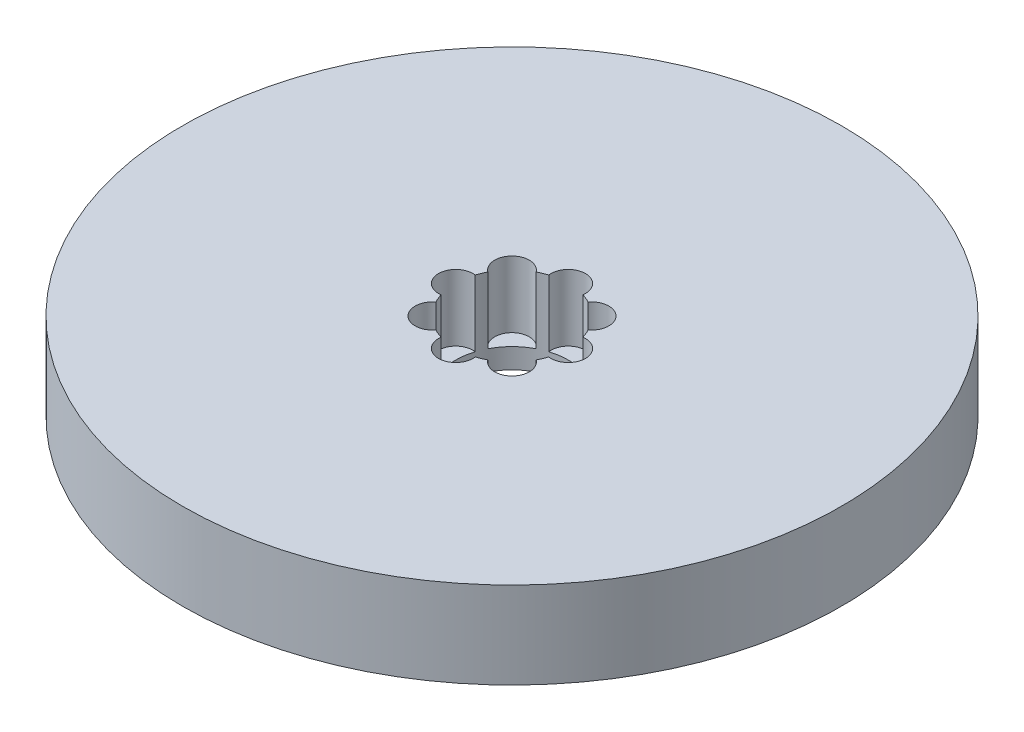
ISO-10303-21;
HEADER;
FILE_DESCRIPTION(('STEP AP214'),'2;1');
FILE_NAME('part.step','',(''),(''),'','','');
FILE_SCHEMA(('AUTOMOTIVE_DESIGN { 1 0 10303 214 1 1 1 1 }'));
ENDSEC;
DATA;
#1=APPLICATION_CONTEXT('core data for automotive mechanical design processes');
#2=APPLICATION_PROTOCOL_DEFINITION('international standard','automotive_design',2000,#1);
#3=PRODUCT_CONTEXT('',#1,'mechanical');
#4=PRODUCT('Part','Part','',(#3));
#5=PRODUCT_RELATED_PRODUCT_CATEGORY('part','',(#4));
#6=PRODUCT_DEFINITION_FORMATION('','',#4);
#7=PRODUCT_DEFINITION_CONTEXT('part definition',#1,'design');
#8=PRODUCT_DEFINITION('design','',#6,#7);
#9=PRODUCT_DEFINITION_SHAPE('','',#8);
#10=(LENGTH_UNIT() NAMED_UNIT(*) SI_UNIT(.MILLI.,.METRE.));
#11=(NAMED_UNIT(*) PLANE_ANGLE_UNIT() SI_UNIT($,.RADIAN.));
#12=(NAMED_UNIT(*) SI_UNIT($,.STERADIAN.) SOLID_ANGLE_UNIT());
#13=UNCERTAINTY_MEASURE_WITH_UNIT(LENGTH_MEASURE(1.E-05),#10,'distance_accuracy_value','');
#14=(GEOMETRIC_REPRESENTATION_CONTEXT(3) GLOBAL_UNCERTAINTY_ASSIGNED_CONTEXT((#13)) GLOBAL_UNIT_ASSIGNED_CONTEXT((#10,
#11,#12)) REPRESENTATION_CONTEXT('',''));
#15=CARTESIAN_POINT('',(0.,0.,0.));
#16=DIRECTION('',(0.,0.,1.));
#17=DIRECTION('',(1.,0.,0.));
#18=AXIS2_PLACEMENT_3D('',#15,#16,#17);
#19=CARTESIAN_POINT('',(0.,23.,0.));
#20=DIRECTION('',(0.,-1.,0.));
#21=DIRECTION('',(0.,0.,-1.));
#22=AXIS2_PLACEMENT_3D('',#19,#20,#21);
#23=CYLINDRICAL_SURFACE('',#22,87.5);
#24=CARTESIAN_POINT('',(0.,23.,0.));
#25=DIRECTION('',(0.,1.,0.));
#26=DIRECTION('',(0.,0.,1.));
#27=AXIS2_PLACEMENT_3D('',#24,#25,#26);
#28=CIRCLE('',#27,87.5);
#29=CARTESIAN_POINT('',(0.,23.,87.5));
#30=VERTEX_POINT('',#29);
#31=EDGE_CURVE('E195',#30,#30,#28,.T.);
#32=ORIENTED_EDGE('',*,*,#31,.F.);
#33=EDGE_LOOP('',(#32));
#34=FACE_BOUND('',#33,.T.);
#35=CARTESIAN_POINT('',(0.,0.,0.));
#36=DIRECTION('',(0.,1.,0.));
#37=DIRECTION('',(0.,0.,1.));
#38=AXIS2_PLACEMENT_3D('',#35,#36,#37);
#39=CIRCLE('',#38,87.5);
#40=CARTESIAN_POINT('',(0.,0.,87.5));
#41=VERTEX_POINT('',#40);
#42=EDGE_CURVE('E179',#41,#41,#39,.T.);
#43=ORIENTED_EDGE('',*,*,#42,.T.);
#44=EDGE_LOOP('',(#43));
#45=FACE_BOUND('',#44,.T.);
#46=ADVANCED_FACE('F39',(#34,#45),#23,.T.);
#47=CARTESIAN_POINT('',(0.,23.,0.));
#48=DIRECTION('',(0.,1.,0.));
#49=DIRECTION('',(0.,0.,1.));
#50=AXIS2_PLACEMENT_3D('',#47,#48,#49);
#51=PLANE('',#50);
#52=CARTESIAN_POINT('',(0.,23.,14.9361001047784));
#53=DIRECTION('',(0.,1.,0.));
#54=DIRECTION('',(1.,0.,0.));
#55=AXIS2_PLACEMENT_3D('',#52,#53,#54);
#56=CIRCLE('',#55,4.58270280839025);
#57=CARTESIAN_POINT('',(-4.53793429302962,23.,14.2971029356351));
#58=VERTEX_POINT('',#57);
#59=CARTESIAN_POINT('',(4.53793429302972,23.,14.2971029356351));
#60=VERTEX_POINT('',#59);
#61=EDGE_CURVE('E176',#58,#60,#56,.T.);
#62=ORIENTED_EDGE('',*,*,#61,.F.);
#63=CARTESIAN_POINT('',(0.,23.,0.));
#64=DIRECTION('',(0.,1.,0.));
#65=DIRECTION('',(0.,0.,1.));
#66=AXIS2_PLACEMENT_3D('',#63,#64,#65);
#67=CIRCLE('',#66,15.);
#68=CARTESIAN_POINT('',(-6.90077432592938,23.,13.3183825482899));
#69=VERTEX_POINT('',#68);
#70=EDGE_CURVE('E166',#69,#58,#67,.T.);
#71=ORIENTED_EDGE('',*,*,#70,.F.);
#72=CARTESIAN_POINT('',(-10.5614176685699,23.,10.56141766857));
#73=DIRECTION('',(0.,1.,0.));
#74=DIRECTION('',(0.707106781186549,0.,0.707106781186546));
#75=AXIS2_PLACEMENT_3D('',#72,#73,#74);
#76=CIRCLE('',#75,4.58270280839025);
#77=CARTESIAN_POINT('',(-13.3183825482899,23.,6.90077432592943));
#78=VERTEX_POINT('',#77);
#79=EDGE_CURVE('E147',#78,#69,#76,.T.);
#80=ORIENTED_EDGE('',*,*,#79,.F.);
#81=CARTESIAN_POINT('',(-14.2971029356351,23.,4.53793429302967));
#82=VERTEX_POINT('',#81);
#83=EDGE_CURVE('E180',#82,#78,#67,.T.);
#84=ORIENTED_EDGE('',*,*,#83,.F.);
#85=CARTESIAN_POINT('',(-14.9361001047784,23.,0.));
#86=DIRECTION('',(0.,1.,0.));
#87=DIRECTION('',(0.,0.,1.));
#88=AXIS2_PLACEMENT_3D('',#85,#86,#87);
#89=CIRCLE('',#88,4.58270280839025);
#90=CARTESIAN_POINT('',(-14.2971029356351,23.,-4.53793429302967));
#91=VERTEX_POINT('',#90);
#92=EDGE_CURVE('E186',#91,#82,#89,.T.);
#93=ORIENTED_EDGE('',*,*,#92,.F.);
#94=CARTESIAN_POINT('',(-13.31838254829,23.,-6.90077432592924));
#95=VERTEX_POINT('',#94);
#96=EDGE_CURVE('E182',#95,#91,#67,.T.);
#97=ORIENTED_EDGE('',*,*,#96,.F.);
#98=CARTESIAN_POINT('',(-10.5614176685701,23.,-10.5614176685698));
#99=DIRECTION('',(0.,1.,0.));
#100=DIRECTION('',(-0.707106781186539,0.,0.707106781186556));
#101=AXIS2_PLACEMENT_3D('',#98,#99,#100);
#102=CIRCLE('',#101,4.58270280839025);
#103=CARTESIAN_POINT('',(-6.90077432592957,23.,-13.3183825482898));
#104=VERTEX_POINT('',#103);
#105=EDGE_CURVE('E446',#104,#95,#102,.T.);
#106=ORIENTED_EDGE('',*,*,#105,.F.);
#107=CARTESIAN_POINT('',(-4.53793429302982,23.,-14.297102935635));
#108=VERTEX_POINT('',#107);
#109=EDGE_CURVE('E452',#108,#104,#67,.T.);
#110=ORIENTED_EDGE('',*,*,#109,.F.);
#111=CARTESIAN_POINT('',(-1.56447344372781E-13,23.,-14.9361001047784));
#112=DIRECTION('',(0.,1.,0.));
#113=DIRECTION('',(-1.,0.,0.));
#114=AXIS2_PLACEMENT_3D('',#111,#112,#113);
#115=CIRCLE('',#114,4.58270280839025);
#116=CARTESIAN_POINT('',(4.53793429302952,23.,-14.2971029356351));
#117=VERTEX_POINT('',#116);
#118=EDGE_CURVE('E477',#117,#108,#115,.T.);
#119=ORIENTED_EDGE('',*,*,#118,.F.);
#120=CARTESIAN_POINT('',(6.90077432592929,23.,-13.31838254829));
#121=VERTEX_POINT('',#120);
#122=EDGE_CURVE('E460',#121,#117,#67,.T.);
#123=ORIENTED_EDGE('',*,*,#122,.F.);
#124=CARTESIAN_POINT('',(10.5614176685698,23.,-10.56141766857));
#125=DIRECTION('',(0.,1.,0.));
#126=DIRECTION('',(-0.707106781186554,0.,-0.707106781186541));
#127=AXIS2_PLACEMENT_3D('',#124,#125,#126);
#128=CIRCLE('',#127,4.58270280839025);
#129=CARTESIAN_POINT('',(13.3183825482899,23.,-6.90077432592952));
#130=VERTEX_POINT('',#129);
#131=EDGE_CURVE('E464',#130,#121,#128,.T.);
#132=ORIENTED_EDGE('',*,*,#131,.F.);
#133=CARTESIAN_POINT('',(14.2971029356351,23.,-4.53793429302967));
#134=VERTEX_POINT('',#133);
#135=EDGE_CURVE('E459',#134,#130,#67,.T.);
#136=ORIENTED_EDGE('',*,*,#135,.F.);
#137=CARTESIAN_POINT('',(14.9361001047784,23.,0.));
#138=DIRECTION('',(0.,1.,0.));
#139=DIRECTION('',(0.,0.,-1.));
#140=AXIS2_PLACEMENT_3D('',#137,#138,#139);
#141=CIRCLE('',#140,4.58270280839025);
#142=CARTESIAN_POINT('',(14.2971029356351,23.,4.53793429302967));
#143=VERTEX_POINT('',#142);
#144=EDGE_CURVE('E469',#143,#134,#141,.T.);
#145=ORIENTED_EDGE('',*,*,#144,.F.);
#146=CARTESIAN_POINT('',(13.31838254829,23.,6.90077432592933));
#147=VERTEX_POINT('',#146);
#148=EDGE_CURVE('E181',#147,#143,#67,.T.);
#149=ORIENTED_EDGE('',*,*,#148,.F.);
#150=CARTESIAN_POINT('',(10.56141766857,23.,10.5614176685699));
#151=DIRECTION('',(0.,1.,0.));
#152=DIRECTION('',(0.707106781186544,0.,-0.707106781186551));
#153=AXIS2_PLACEMENT_3D('',#150,#151,#152);
#154=CIRCLE('',#153,4.58270280839025);
#155=CARTESIAN_POINT('',(6.90077432592947,23.,13.3183825482899));
#156=VERTEX_POINT('',#155);
#157=EDGE_CURVE('E475',#156,#147,#154,.T.);
#158=ORIENTED_EDGE('',*,*,#157,.F.);
#159=EDGE_CURVE('E177',#60,#156,#67,.T.);
#160=ORIENTED_EDGE('',*,*,#159,.F.);
#161=EDGE_LOOP('',(#62,#71,#80,#84,#93,#97,#106,#110,#119,#123,#132,#136,#145,#149,#158,#160));
#162=FACE_BOUND('',#161,.T.);
#163=ORIENTED_EDGE('',*,*,#31,.T.);
#164=EDGE_LOOP('',(#163));
#165=FACE_BOUND('',#164,.T.);
#166=ADVANCED_FACE('F172',(#162,#165),#51,.T.);
#167=CARTESIAN_POINT('',(0.,0.,0.));
#168=DIRECTION('',(0.,1.,0.));
#169=DIRECTION('',(0.,0.,1.));
#170=AXIS2_PLACEMENT_3D('',#167,#168,#169);
#171=PLANE('',#170);
#172=CARTESIAN_POINT('',(0.,0.,0.));
#173=DIRECTION('',(0.,1.,0.));
#174=DIRECTION('',(0.,0.,1.));
#175=AXIS2_PLACEMENT_3D('',#172,#173,#174);
#176=CIRCLE('',#175,15.);
#177=CARTESIAN_POINT('',(0.,0.,15.));
#178=VERTEX_POINT('',#177);
#179=EDGE_CURVE('E187',#178,#178,#176,.T.);
#180=ORIENTED_EDGE('',*,*,#179,.T.);
#181=EDGE_LOOP('',(#180));
#182=FACE_BOUND('',#181,.T.);
#183=ORIENTED_EDGE('',*,*,#42,.F.);
#184=EDGE_LOOP('',(#183));
#185=FACE_BOUND('',#184,.T.);
#186=ADVANCED_FACE('F270',(#182,#185),#171,.F.);
#187=CARTESIAN_POINT('',(0.,23.,0.));
#188=DIRECTION('',(0.,-1.,0.));
#189=DIRECTION('',(0.,0.,-1.));
#190=AXIS2_PLACEMENT_3D('',#187,#188,#189);
#191=CYLINDRICAL_SURFACE('',#190,15.);
#192=DIRECTION('',(0.,1.,0.));
#193=VECTOR('',#192,1.);
#194=CARTESIAN_POINT('',(-4.53793429302962,14.1819101958631,14.2971029356351));
#195=LINE('',#194,#193);
#196=CARTESIAN_POINT('',(-4.53793429302962,5.36382039172626,14.2971029356351));
#197=VERTEX_POINT('',#196);
#198=EDGE_CURVE('E11',#197,#58,#195,.T.);
#199=ORIENTED_EDGE('',*,*,#198,.F.);
#200=CARTESIAN_POINT('',(0.,5.36382039172626,0.));
#201=DIRECTION('',(0.,1.,0.));
#202=DIRECTION('',(0.,0.,1.));
#203=AXIS2_PLACEMENT_3D('',#200,#201,#202);
#204=CIRCLE('',#203,15.);
#205=CARTESIAN_POINT('',(4.53793429302972,5.36382039172626,14.2971029356351));
#206=VERTEX_POINT('',#205);
#207=EDGE_CURVE('E250',#197,#206,#204,.T.);
#208=ORIENTED_EDGE('',*,*,#207,.T.);
#209=DIRECTION('',(0.,1.,0.));
#210=VECTOR('',#209,1.);
#211=CARTESIAN_POINT('',(4.53793429302972,14.1819101958631,14.2971029356351));
#212=LINE('',#211,#210);
#213=EDGE_CURVE('E46',#60,#206,#212,.F.);
#214=ORIENTED_EDGE('',*,*,#213,.F.);
#215=ORIENTED_EDGE('',*,*,#159,.T.);
#216=DIRECTION('',(0.,1.,0.));
#217=VECTOR('',#216,1.);
#218=CARTESIAN_POINT('',(6.90077432592947,14.1819101958631,13.3183825482899));
#219=LINE('',#218,#217);
#220=CARTESIAN_POINT('',(6.90077432592947,5.36382039172626,13.3183825482899));
#221=VERTEX_POINT('',#220);
#222=EDGE_CURVE('E244',#221,#156,#219,.T.);
#223=ORIENTED_EDGE('',*,*,#222,.F.);
#224=CARTESIAN_POINT('',(0.,5.36382039172626,0.));
#225=DIRECTION('',(0.,1.,0.));
#226=DIRECTION('',(0.,0.,1.));
#227=AXIS2_PLACEMENT_3D('',#224,#225,#226);
#228=CIRCLE('',#227,15.);
#229=CARTESIAN_POINT('',(13.31838254829,5.36382039172626,6.90077432592933));
#230=VERTEX_POINT('',#229);
#231=EDGE_CURVE('E238',#221,#230,#228,.T.);
#232=ORIENTED_EDGE('',*,*,#231,.T.);
#233=DIRECTION('',(0.,1.,0.));
#234=VECTOR('',#233,1.);
#235=CARTESIAN_POINT('',(13.31838254829,14.1819101958631,6.90077432592933));
#236=LINE('',#235,#234);
#237=EDGE_CURVE('E242',#147,#230,#236,.F.);
#238=ORIENTED_EDGE('',*,*,#237,.F.);
#239=ORIENTED_EDGE('',*,*,#148,.T.);
#240=DIRECTION('',(0.,1.,0.));
#241=VECTOR('',#240,1.);
#242=CARTESIAN_POINT('',(14.2971029356351,14.1819101958631,4.53793429302967));
#243=LINE('',#242,#241);
#244=CARTESIAN_POINT('',(14.2971029356351,5.36382039172626,4.53793429302967));
#245=VERTEX_POINT('',#244);
#246=EDGE_CURVE('E236',#245,#143,#243,.T.);
#247=ORIENTED_EDGE('',*,*,#246,.F.);
#248=CARTESIAN_POINT('',(0.,5.36382039172626,0.));
#249=DIRECTION('',(0.,1.,0.));
#250=DIRECTION('',(0.,0.,1.));
#251=AXIS2_PLACEMENT_3D('',#248,#249,#250);
#252=CIRCLE('',#251,15.);
#253=CARTESIAN_POINT('',(14.2971029356351,5.36382039172626,-4.53793429302967));
#254=VERTEX_POINT('',#253);
#255=EDGE_CURVE('E235',#245,#254,#252,.T.);
#256=ORIENTED_EDGE('',*,*,#255,.T.);
#257=DIRECTION('',(0.,1.,0.));
#258=VECTOR('',#257,1.);
#259=CARTESIAN_POINT('',(14.2971029356351,14.1819101958631,-4.53793429302967));
#260=LINE('',#259,#258);
#261=EDGE_CURVE('E234',#134,#254,#260,.F.);
#262=ORIENTED_EDGE('',*,*,#261,.F.);
#263=ORIENTED_EDGE('',*,*,#135,.T.);
#264=DIRECTION('',(0.,1.,0.));
#265=VECTOR('',#264,1.);
#266=CARTESIAN_POINT('',(13.3183825482899,14.1819101958631,-6.90077432592952));
#267=LINE('',#266,#265);
#268=CARTESIAN_POINT('',(13.3183825482899,5.36382039172626,-6.90077432592952));
#269=VERTEX_POINT('',#268);
#270=EDGE_CURVE('E229',#269,#130,#267,.T.);
#271=ORIENTED_EDGE('',*,*,#270,.F.);
#272=CARTESIAN_POINT('',(0.,5.36382039172626,0.));
#273=DIRECTION('',(0.,1.,0.));
#274=DIRECTION('',(0.,0.,1.));
#275=AXIS2_PLACEMENT_3D('',#272,#273,#274);
#276=CIRCLE('',#275,15.);
#277=CARTESIAN_POINT('',(6.90077432592929,5.36382039172626,-13.31838254829));
#278=VERTEX_POINT('',#277);
#279=EDGE_CURVE('E221',#269,#278,#276,.T.);
#280=ORIENTED_EDGE('',*,*,#279,.T.);
#281=DIRECTION('',(0.,1.,0.));
#282=VECTOR('',#281,1.);
#283=CARTESIAN_POINT('',(6.90077432592929,14.1819101958631,-13.31838254829));
#284=LINE('',#283,#282);
#285=EDGE_CURVE('E230',#121,#278,#284,.F.);
#286=ORIENTED_EDGE('',*,*,#285,.F.);
#287=ORIENTED_EDGE('',*,*,#122,.T.);
#288=DIRECTION('',(0.,1.,0.));
#289=VECTOR('',#288,1.);
#290=CARTESIAN_POINT('',(4.53793429302952,14.1819101958631,-14.2971029356351));
#291=LINE('',#290,#289);
#292=CARTESIAN_POINT('',(4.53793429302952,5.36382039172626,-14.2971029356351));
#293=VERTEX_POINT('',#292);
#294=EDGE_CURVE('E225',#293,#117,#291,.T.);
#295=ORIENTED_EDGE('',*,*,#294,.F.);
#296=CARTESIAN_POINT('',(0.,5.36382039172626,0.));
#297=DIRECTION('',(0.,1.,0.));
#298=DIRECTION('',(0.,0.,1.));
#299=AXIS2_PLACEMENT_3D('',#296,#297,#298);
#300=CIRCLE('',#299,15.);
#301=CARTESIAN_POINT('',(-4.53793429302982,5.36382039172626,-14.297102935635));
#302=VERTEX_POINT('',#301);
#303=EDGE_CURVE('E216',#293,#302,#300,.T.);
#304=ORIENTED_EDGE('',*,*,#303,.T.);
#305=DIRECTION('',(0.,1.,0.));
#306=VECTOR('',#305,1.);
#307=CARTESIAN_POINT('',(-4.53793429302982,14.1819101958631,-14.297102935635));
#308=LINE('',#307,#306);
#309=EDGE_CURVE('E218',#108,#302,#308,.F.);
#310=ORIENTED_EDGE('',*,*,#309,.F.);
#311=ORIENTED_EDGE('',*,*,#109,.T.);
#312=DIRECTION('',(0.,1.,0.));
#313=VECTOR('',#312,1.);
#314=CARTESIAN_POINT('',(-6.90077432592956,14.1819101958631,-13.3183825482898));
#315=LINE('',#314,#313);
#316=CARTESIAN_POINT('',(-6.90077432592957,5.36382039172626,-13.3183825482898));
#317=VERTEX_POINT('',#316);
#318=EDGE_CURVE('E212',#317,#104,#315,.T.);
#319=ORIENTED_EDGE('',*,*,#318,.F.);
#320=CARTESIAN_POINT('',(0.,5.36382039172626,0.));
#321=DIRECTION('',(0.,1.,0.));
#322=DIRECTION('',(0.,0.,1.));
#323=AXIS2_PLACEMENT_3D('',#320,#321,#322);
#324=CIRCLE('',#323,15.);
#325=CARTESIAN_POINT('',(-13.31838254829,5.36382039172626,-6.90077432592924));
#326=VERTEX_POINT('',#325);
#327=EDGE_CURVE('E208',#317,#326,#324,.T.);
#328=ORIENTED_EDGE('',*,*,#327,.T.);
#329=DIRECTION('',(0.,1.,0.));
#330=VECTOR('',#329,1.);
#331=CARTESIAN_POINT('',(-13.31838254829,14.1819101958631,-6.90077432592924));
#332=LINE('',#331,#330);
#333=EDGE_CURVE('E211',#95,#326,#332,.F.);
#334=ORIENTED_EDGE('',*,*,#333,.F.);
#335=ORIENTED_EDGE('',*,*,#96,.T.);
#336=DIRECTION('',(0.,1.,0.));
#337=VECTOR('',#336,1.);
#338=CARTESIAN_POINT('',(-14.2971029356351,14.1819101958631,-4.53793429302967));
#339=LINE('',#338,#337);
#340=CARTESIAN_POINT('',(-14.2971029356351,5.36382039172626,-4.53793429302967));
#341=VERTEX_POINT('',#340);
#342=EDGE_CURVE('E201',#341,#91,#339,.T.);
#343=ORIENTED_EDGE('',*,*,#342,.F.);
#344=CARTESIAN_POINT('',(0.,5.36382039172626,0.));
#345=DIRECTION('',(0.,1.,0.));
#346=DIRECTION('',(0.,0.,1.));
#347=AXIS2_PLACEMENT_3D('',#344,#345,#346);
#348=CIRCLE('',#347,15.);
#349=CARTESIAN_POINT('',(-14.2971029356351,5.36382039172626,4.53793429302967));
#350=VERTEX_POINT('',#349);
#351=EDGE_CURVE('E194',#341,#350,#348,.T.);
#352=ORIENTED_EDGE('',*,*,#351,.T.);
#353=DIRECTION('',(0.,1.,0.));
#354=VECTOR('',#353,1.);
#355=CARTESIAN_POINT('',(-14.2971029356351,14.1819101958631,4.53793429302967));
#356=LINE('',#355,#354);
#357=EDGE_CURVE('E199',#82,#350,#356,.F.);
#358=ORIENTED_EDGE('',*,*,#357,.F.);
#359=ORIENTED_EDGE('',*,*,#83,.T.);
#360=DIRECTION('',(0.,1.,0.));
#361=VECTOR('',#360,1.);
#362=CARTESIAN_POINT('',(-13.3183825482899,14.1819101958631,6.90077432592943));
#363=LINE('',#362,#361);
#364=CARTESIAN_POINT('',(-13.3183825482899,5.36382039172626,6.90077432592943));
#365=VERTEX_POINT('',#364);
#366=EDGE_CURVE('E160',#365,#78,#363,.T.);
#367=ORIENTED_EDGE('',*,*,#366,.F.);
#368=CARTESIAN_POINT('',(0.,5.36382039172626,0.));
#369=DIRECTION('',(0.,1.,0.));
#370=DIRECTION('',(0.,0.,1.));
#371=AXIS2_PLACEMENT_3D('',#368,#369,#370);
#372=CIRCLE('',#371,15.);
#373=CARTESIAN_POINT('',(-6.90077432592938,5.36382039172626,13.3183825482899));
#374=VERTEX_POINT('',#373);
#375=EDGE_CURVE('E168',#365,#374,#372,.T.);
#376=ORIENTED_EDGE('',*,*,#375,.T.);
#377=DIRECTION('',(0.,1.,0.));
#378=VECTOR('',#377,1.);
#379=CARTESIAN_POINT('',(-6.90077432592938,14.1819101958631,13.3183825482899));
#380=LINE('',#379,#378);
#381=EDGE_CURVE('E152',#69,#374,#380,.F.);
#382=ORIENTED_EDGE('',*,*,#381,.F.);
#383=ORIENTED_EDGE('',*,*,#70,.T.);
#384=EDGE_LOOP('',(#199,#208,#214,#215,#223,#232,#238,#239,#247,#256,#262,#263,#271,#280,#286,
#287,#295,#304,#310,#311,#319,#328,#334,#335,#343,#352,#358,#359,#367,#376,#382,#383));
#385=FACE_BOUND('',#384,.T.);
#386=ORIENTED_EDGE('',*,*,#179,.F.);
#387=EDGE_LOOP('',(#386));
#388=FACE_BOUND('',#387,.T.);
#389=ADVANCED_FACE('F170',(#385,#388),#191,.F.);
#390=CARTESIAN_POINT('',(-14.9361001047784,5.36382039172626,0.));
#391=DIRECTION('',(0.,1.,0.));
#392=DIRECTION('',(0.,0.,1.));
#393=AXIS2_PLACEMENT_3D('',#390,#391,#392);
#394=CYLINDRICAL_SURFACE('',#393,4.58270280839025);
#395=ORIENTED_EDGE('',*,*,#342,.T.);
#396=ORIENTED_EDGE('',*,*,#92,.T.);
#397=ORIENTED_EDGE('',*,*,#357,.T.);
#398=CARTESIAN_POINT('',(-14.9361001047784,5.36382039172626,0.));
#399=DIRECTION('',(0.,1.,0.));
#400=DIRECTION('',(0.,0.,1.));
#401=AXIS2_PLACEMENT_3D('',#398,#399,#400);
#402=CIRCLE('',#401,4.58270280839025);
#403=EDGE_CURVE('E191',#341,#350,#402,.T.);
#404=ORIENTED_EDGE('',*,*,#403,.F.);
#405=EDGE_LOOP('',(#395,#396,#397,#404));
#406=FACE_BOUND('',#405,.T.);
#407=ADVANCED_FACE('F279',(#406),#394,.F.);
#408=CARTESIAN_POINT('',(-14.9361001047784,5.36382039172626,0.));
#409=DIRECTION('',(0.,1.,0.));
#410=DIRECTION('',(0.,0.,1.));
#411=AXIS2_PLACEMENT_3D('',#408,#409,#410);
#412=PLANE('',#411);
#413=ORIENTED_EDGE('',*,*,#403,.T.);
#414=ORIENTED_EDGE('',*,*,#351,.F.);
#415=EDGE_LOOP('',(#413,#414));
#416=FACE_BOUND('',#415,.T.);
#417=ADVANCED_FACE('F285',(#416),#412,.T.);
#418=CARTESIAN_POINT('',(-10.5614176685699,5.36382039172626,10.56141766857));
#419=DIRECTION('',(0.,1.,0.));
#420=DIRECTION('',(0.,0.,1.));
#421=AXIS2_PLACEMENT_3D('',#418,#419,#420);
#422=CYLINDRICAL_SURFACE('',#421,4.58270280839025);
#423=ORIENTED_EDGE('',*,*,#366,.T.);
#424=ORIENTED_EDGE('',*,*,#79,.T.);
#425=ORIENTED_EDGE('',*,*,#381,.T.);
#426=CARTESIAN_POINT('',(-10.5614176685699,5.36382039172626,10.56141766857));
#427=DIRECTION('',(0.,1.,0.));
#428=DIRECTION('',(0.707106781186549,0.,0.707106781186546));
#429=AXIS2_PLACEMENT_3D('',#426,#427,#428);
#430=CIRCLE('',#429,4.58270280839025);
#431=EDGE_CURVE('E165',#365,#374,#430,.T.);
#432=ORIENTED_EDGE('',*,*,#431,.F.);
#433=EDGE_LOOP('',(#423,#424,#425,#432));
#434=FACE_BOUND('',#433,.T.);
#435=ADVANCED_FACE('F155',(#434),#422,.F.);
#436=CARTESIAN_POINT('',(-10.5614176685699,5.36382039172626,10.56141766857));
#437=DIRECTION('',(0.,1.,0.));
#438=DIRECTION('',(0.707106781186549,0.,0.707106781186546));
#439=AXIS2_PLACEMENT_3D('',#436,#437,#438);
#440=PLANE('',#439);
#441=ORIENTED_EDGE('',*,*,#431,.T.);
#442=ORIENTED_EDGE('',*,*,#375,.F.);
#443=EDGE_LOOP('',(#441,#442));
#444=FACE_BOUND('',#443,.T.);
#445=ADVANCED_FACE('F288',(#444),#440,.T.);
#446=CARTESIAN_POINT('',(-10.5614176685701,5.36382039172626,-10.5614176685698));
#447=DIRECTION('',(0.,1.,0.));
#448=DIRECTION('',(0.,0.,1.));
#449=AXIS2_PLACEMENT_3D('',#446,#447,#448);
#450=CYLINDRICAL_SURFACE('',#449,4.58270280839025);
#451=ORIENTED_EDGE('',*,*,#318,.T.);
#452=ORIENTED_EDGE('',*,*,#105,.T.);
#453=ORIENTED_EDGE('',*,*,#333,.T.);
#454=CARTESIAN_POINT('',(-10.5614176685701,5.36382039172626,-10.5614176685698));
#455=DIRECTION('',(0.,1.,0.));
#456=DIRECTION('',(-0.707106781186539,0.,0.707106781186556));
#457=AXIS2_PLACEMENT_3D('',#454,#455,#456);
#458=CIRCLE('',#457,4.58270280839025);
#459=EDGE_CURVE('E447',#317,#326,#458,.T.);
#460=ORIENTED_EDGE('',*,*,#459,.F.);
#461=EDGE_LOOP('',(#451,#452,#453,#460));
#462=FACE_BOUND('',#461,.T.);
#463=ADVANCED_FACE('F295',(#462),#450,.F.);
#464=CARTESIAN_POINT('',(-10.5614176685701,5.36382039172626,-10.5614176685698));
#465=DIRECTION('',(0.,1.,0.));
#466=DIRECTION('',(-0.707106781186539,0.,0.707106781186556));
#467=AXIS2_PLACEMENT_3D('',#464,#465,#466);
#468=PLANE('',#467);
#469=ORIENTED_EDGE('',*,*,#459,.T.);
#470=ORIENTED_EDGE('',*,*,#327,.F.);
#471=EDGE_LOOP('',(#469,#470));
#472=FACE_BOUND('',#471,.T.);
#473=ADVANCED_FACE('F375',(#472),#468,.T.);
#474=CARTESIAN_POINT('',(-1.56447344372781E-13,5.36382039172626,-14.9361001047784));
#475=DIRECTION('',(0.,1.,0.));
#476=DIRECTION('',(0.,0.,1.));
#477=AXIS2_PLACEMENT_3D('',#474,#475,#476);
#478=CYLINDRICAL_SURFACE('',#477,4.58270280839025);
#479=ORIENTED_EDGE('',*,*,#294,.T.);
#480=ORIENTED_EDGE('',*,*,#118,.T.);
#481=ORIENTED_EDGE('',*,*,#309,.T.);
#482=CARTESIAN_POINT('',(-1.56447344372781E-13,5.36382039172626,-14.9361001047784));
#483=DIRECTION('',(0.,1.,0.));
#484=DIRECTION('',(-1.,0.,0.));
#485=AXIS2_PLACEMENT_3D('',#482,#483,#484);
#486=CIRCLE('',#485,4.58270280839025);
#487=EDGE_CURVE('E467',#293,#302,#486,.T.);
#488=ORIENTED_EDGE('',*,*,#487,.F.);
#489=EDGE_LOOP('',(#479,#480,#481,#488));
#490=FACE_BOUND('',#489,.T.);
#491=ADVANCED_FACE('F361',(#490),#478,.F.);
#492=CARTESIAN_POINT('',(-1.56447344372781E-13,5.36382039172626,-14.9361001047784));
#493=DIRECTION('',(0.,1.,0.));
#494=DIRECTION('',(-1.,0.,0.));
#495=AXIS2_PLACEMENT_3D('',#492,#493,#494);
#496=PLANE('',#495);
#497=ORIENTED_EDGE('',*,*,#487,.T.);
#498=ORIENTED_EDGE('',*,*,#303,.F.);
#499=EDGE_LOOP('',(#497,#498));
#500=FACE_BOUND('',#499,.T.);
#501=ADVANCED_FACE('F297',(#500),#496,.T.);
#502=CARTESIAN_POINT('',(10.5614176685698,5.36382039172626,-10.56141766857));
#503=DIRECTION('',(0.,1.,0.));
#504=DIRECTION('',(0.,0.,1.));
#505=AXIS2_PLACEMENT_3D('',#502,#503,#504);
#506=CYLINDRICAL_SURFACE('',#505,4.58270280839025);
#507=ORIENTED_EDGE('',*,*,#270,.T.);
#508=ORIENTED_EDGE('',*,*,#131,.T.);
#509=ORIENTED_EDGE('',*,*,#285,.T.);
#510=CARTESIAN_POINT('',(10.5614176685698,5.36382039172626,-10.56141766857));
#511=DIRECTION('',(0.,1.,0.));
#512=DIRECTION('',(-0.707106781186554,0.,-0.707106781186541));
#513=AXIS2_PLACEMENT_3D('',#510,#511,#512);
#514=CIRCLE('',#513,4.58270280839025);
#515=EDGE_CURVE('E470',#269,#278,#514,.T.);
#516=ORIENTED_EDGE('',*,*,#515,.F.);
#517=EDGE_LOOP('',(#507,#508,#509,#516));
#518=FACE_BOUND('',#517,.T.);
#519=ADVANCED_FACE('F294',(#518),#506,.F.);
#520=CARTESIAN_POINT('',(10.5614176685698,5.36382039172626,-10.56141766857));
#521=DIRECTION('',(0.,1.,0.));
#522=DIRECTION('',(-0.707106781186554,0.,-0.707106781186541));
#523=AXIS2_PLACEMENT_3D('',#520,#521,#522);
#524=PLANE('',#523);
#525=ORIENTED_EDGE('',*,*,#515,.T.);
#526=ORIENTED_EDGE('',*,*,#279,.F.);
#527=EDGE_LOOP('',(#525,#526));
#528=FACE_BOUND('',#527,.T.);
#529=ADVANCED_FACE('F300',(#528),#524,.T.);
#530=CARTESIAN_POINT('',(14.9361001047784,5.36382039172626,0.));
#531=DIRECTION('',(0.,1.,0.));
#532=DIRECTION('',(0.,0.,1.));
#533=AXIS2_PLACEMENT_3D('',#530,#531,#532);
#534=CYLINDRICAL_SURFACE('',#533,4.58270280839025);
#535=ORIENTED_EDGE('',*,*,#246,.T.);
#536=ORIENTED_EDGE('',*,*,#144,.T.);
#537=ORIENTED_EDGE('',*,*,#261,.T.);
#538=CARTESIAN_POINT('',(14.9361001047784,5.36382039172626,0.));
#539=DIRECTION('',(0.,1.,0.));
#540=DIRECTION('',(0.,0.,-1.));
#541=AXIS2_PLACEMENT_3D('',#538,#539,#540);
#542=CIRCLE('',#541,4.58270280839025);
#543=EDGE_CURVE('E472',#245,#254,#542,.T.);
#544=ORIENTED_EDGE('',*,*,#543,.F.);
#545=EDGE_LOOP('',(#535,#536,#537,#544));
#546=FACE_BOUND('',#545,.T.);
#547=ADVANCED_FACE('F305',(#546),#534,.F.);
#548=CARTESIAN_POINT('',(14.9361001047784,5.36382039172626,0.));
#549=DIRECTION('',(0.,1.,0.));
#550=DIRECTION('',(0.,0.,-1.));
#551=AXIS2_PLACEMENT_3D('',#548,#549,#550);
#552=PLANE('',#551);
#553=ORIENTED_EDGE('',*,*,#543,.T.);
#554=ORIENTED_EDGE('',*,*,#255,.F.);
#555=EDGE_LOOP('',(#553,#554));
#556=FACE_BOUND('',#555,.T.);
#557=ADVANCED_FACE('F308',(#556),#552,.T.);
#558=CARTESIAN_POINT('',(10.56141766857,5.36382039172626,10.5614176685699));
#559=DIRECTION('',(0.,1.,0.));
#560=DIRECTION('',(0.,0.,1.));
#561=AXIS2_PLACEMENT_3D('',#558,#559,#560);
#562=CYLINDRICAL_SURFACE('',#561,4.58270280839025);
#563=ORIENTED_EDGE('',*,*,#222,.T.);
#564=ORIENTED_EDGE('',*,*,#157,.T.);
#565=ORIENTED_EDGE('',*,*,#237,.T.);
#566=CARTESIAN_POINT('',(10.56141766857,5.36382039172626,10.5614176685699));
#567=DIRECTION('',(0.,1.,0.));
#568=DIRECTION('',(0.707106781186544,0.,-0.707106781186551));
#569=AXIS2_PLACEMENT_3D('',#566,#567,#568);
#570=CIRCLE('',#569,4.58270280839025);
#571=EDGE_CURVE('E56',#221,#230,#570,.T.);
#572=ORIENTED_EDGE('',*,*,#571,.F.);
#573=EDGE_LOOP('',(#563,#564,#565,#572));
#574=FACE_BOUND('',#573,.T.);
#575=ADVANCED_FACE('F309',(#574),#562,.F.);
#576=CARTESIAN_POINT('',(10.56141766857,5.36382039172626,10.5614176685699));
#577=DIRECTION('',(0.,1.,0.));
#578=DIRECTION('',(0.707106781186544,0.,-0.707106781186551));
#579=AXIS2_PLACEMENT_3D('',#576,#577,#578);
#580=PLANE('',#579);
#581=ORIENTED_EDGE('',*,*,#571,.T.);
#582=ORIENTED_EDGE('',*,*,#231,.F.);
#583=EDGE_LOOP('',(#581,#582));
#584=FACE_BOUND('',#583,.T.);
#585=ADVANCED_FACE('F256',(#584),#580,.T.);
#586=CARTESIAN_POINT('',(0.,5.36382039172626,14.9361001047784));
#587=DIRECTION('',(0.,1.,0.));
#588=DIRECTION('',(0.,0.,1.));
#589=AXIS2_PLACEMENT_3D('',#586,#587,#588);
#590=CYLINDRICAL_SURFACE('',#589,4.58270280839025);
#591=ORIENTED_EDGE('',*,*,#198,.T.);
#592=ORIENTED_EDGE('',*,*,#61,.T.);
#593=ORIENTED_EDGE('',*,*,#213,.T.);
#594=CARTESIAN_POINT('',(0.,5.36382039172626,14.9361001047784));
#595=DIRECTION('',(0.,1.,0.));
#596=DIRECTION('',(1.,0.,0.));
#597=AXIS2_PLACEMENT_3D('',#594,#595,#596);
#598=CIRCLE('',#597,4.58270280839025);
#599=EDGE_CURVE('E55',#197,#206,#598,.T.);
#600=ORIENTED_EDGE('',*,*,#599,.F.);
#601=EDGE_LOOP('',(#591,#592,#593,#600));
#602=FACE_BOUND('',#601,.T.);
#603=ADVANCED_FACE('F253',(#602),#590,.F.);
#604=CARTESIAN_POINT('',(0.,5.36382039172626,14.9361001047784));
#605=DIRECTION('',(0.,1.,0.));
#606=DIRECTION('',(1.,0.,0.));
#607=AXIS2_PLACEMENT_3D('',#604,#605,#606);
#608=PLANE('',#607);
#609=ORIENTED_EDGE('',*,*,#599,.T.);
#610=ORIENTED_EDGE('',*,*,#207,.F.);
#611=EDGE_LOOP('',(#609,#610));
#612=FACE_BOUND('',#611,.T.);
#613=ADVANCED_FACE('F252',(#612),#608,.T.);
#614=CLOSED_SHELL('',(#46,#166,#186,#389,#407,#417,#435,#445,#463,#473,#491,#501,#519,#529,#547,
#557,#575,#585,#603,#613));
#615=MANIFOLD_SOLID_BREP('B2',#614);
#616=ADVANCED_BREP_SHAPE_REPRESENTATION('',(#18,#615),#14);
#617=SHAPE_DEFINITION_REPRESENTATION(#9,#616);
ENDSEC;
END-ISO-10303-21;
